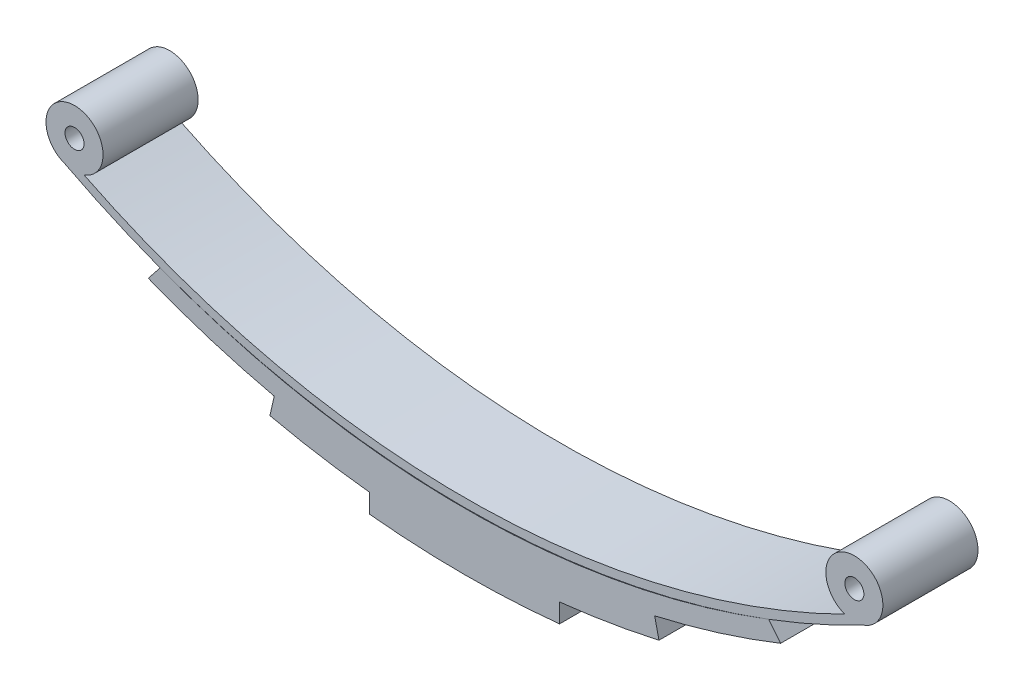
ISO-10303-21;
HEADER;
FILE_DESCRIPTION(('STEP AP214'),'2;1');
FILE_NAME('part.step','',(''),(''),'','','');
FILE_SCHEMA(('AUTOMOTIVE_DESIGN { 1 0 10303 214 1 1 1 1 }'));
ENDSEC;
DATA;
#1=APPLICATION_CONTEXT('core data for automotive mechanical design processes');
#2=APPLICATION_PROTOCOL_DEFINITION('international standard','automotive_design',2000,#1);
#3=PRODUCT_CONTEXT('',#1,'mechanical');
#4=PRODUCT('Part','Part','',(#3));
#5=PRODUCT_RELATED_PRODUCT_CATEGORY('part','',(#4));
#6=PRODUCT_DEFINITION_FORMATION('','',#4);
#7=PRODUCT_DEFINITION_CONTEXT('part definition',#1,'design');
#8=PRODUCT_DEFINITION('design','',#6,#7);
#9=PRODUCT_DEFINITION_SHAPE('','',#8);
#10=(LENGTH_UNIT() NAMED_UNIT(*) SI_UNIT(.MILLI.,.METRE.));
#11=(NAMED_UNIT(*) PLANE_ANGLE_UNIT() SI_UNIT($,.RADIAN.));
#12=(NAMED_UNIT(*) SI_UNIT($,.STERADIAN.) SOLID_ANGLE_UNIT());
#13=UNCERTAINTY_MEASURE_WITH_UNIT(LENGTH_MEASURE(1.E-05),#10,'distance_accuracy_value','');
#14=(GEOMETRIC_REPRESENTATION_CONTEXT(3) GLOBAL_UNCERTAINTY_ASSIGNED_CONTEXT((#13)) GLOBAL_UNIT_ASSIGNED_CONTEXT((#10,
#11,#12)) REPRESENTATION_CONTEXT('',''));
#15=CARTESIAN_POINT('',(0.,0.,0.));
#16=DIRECTION('',(0.,0.,1.));
#17=DIRECTION('',(1.,0.,0.));
#18=AXIS2_PLACEMENT_3D('',#15,#16,#17);
#19=CARTESIAN_POINT('',(0.,78.5770417683242,10.));
#20=DIRECTION('',(0.,0.,-1.));
#21=DIRECTION('',(-1.,0.,0.));
#22=AXIS2_PLACEMENT_3D('',#19,#20,#21);
#23=CYLINDRICAL_SURFACE('',#22,93.);
#24=DIRECTION('',(0.,0.,-1.));
#25=VECTOR('',#24,1.);
#26=CARTESIAN_POINT('',(-10.,-13.8837607373863,10.));
#27=LINE('',#26,#25);
#28=CARTESIAN_POINT('',(-10.,-13.8837607373863,10.));
#29=VERTEX_POINT('',#28);
#30=CARTESIAN_POINT('',(-10.,-13.8837607373863,0.));
#31=VERTEX_POINT('',#30);
#32=EDGE_CURVE('E68',#29,#31,#27,.T.);
#33=ORIENTED_EDGE('',*,*,#32,.F.);
#34=CARTESIAN_POINT('',(0.,78.5770417683242,10.));
#35=DIRECTION('',(0.,0.,1.));
#36=DIRECTION('',(1.,0.,0.));
#37=AXIS2_PLACEMENT_3D('',#34,#35,#36);
#38=CIRCLE('',#37,93.);
#39=CARTESIAN_POINT('',(-20.4558423058385,-12.1453838802367,10.));
#40=VERTEX_POINT('',#39);
#41=EDGE_CURVE('E142',#40,#29,#38,.T.);
#42=ORIENTED_EDGE('',*,*,#41,.F.);
#43=DIRECTION('',(0.,0.,-1.));
#44=VECTOR('',#43,1.);
#45=CARTESIAN_POINT('',(-20.4558423058385,-12.1453838802367,10.));
#46=LINE('',#45,#44);
#47=CARTESIAN_POINT('',(-20.4558423058385,-12.1453838802367,0.));
#48=VERTEX_POINT('',#47);
#49=EDGE_CURVE('E191',#40,#48,#46,.T.);
#50=ORIENTED_EDGE('',*,*,#49,.T.);
#51=CARTESIAN_POINT('',(0.,78.5770417683242,0.));
#52=DIRECTION('',(0.,0.,1.));
#53=DIRECTION('',(1.,0.,0.));
#54=AXIS2_PLACEMENT_3D('',#51,#52,#53);
#55=CIRCLE('',#54,93.);
#56=EDGE_CURVE('E182',#48,#31,#55,.T.);
#57=ORIENTED_EDGE('',*,*,#56,.T.);
#58=EDGE_LOOP('',(#33,#42,#50,#57));
#59=FACE_BOUND('',#58,.T.);
#60=ADVANCED_FACE('F45',(#59),#23,.T.);
#61=DIRECTION('',(0.,0.,-1.));
#62=VECTOR('',#61,1.);
#63=CARTESIAN_POINT('',(10.,-13.8837607373863,10.));
#64=LINE('',#63,#62);
#65=CARTESIAN_POINT('',(10.,-13.8837607373863,10.));
#66=VERTEX_POINT('',#65);
#67=CARTESIAN_POINT('',(10.,-13.8837607373863,0.));
#68=VERTEX_POINT('',#67);
#69=EDGE_CURVE('E160',#66,#68,#64,.T.);
#70=ORIENTED_EDGE('',*,*,#69,.T.);
#71=CARTESIAN_POINT('',(20.4558423058385,-12.1453838802367,0.));
#72=VERTEX_POINT('',#71);
#73=EDGE_CURVE('E181',#68,#72,#55,.T.);
#74=ORIENTED_EDGE('',*,*,#73,.T.);
#75=DIRECTION('',(0.,0.,-1.));
#76=VECTOR('',#75,1.);
#77=CARTESIAN_POINT('',(20.4558423058385,-12.1453838802367,10.));
#78=LINE('',#77,#76);
#79=CARTESIAN_POINT('',(20.4558423058385,-12.1453838802367,10.));
#80=VERTEX_POINT('',#79);
#81=EDGE_CURVE('E188',#80,#72,#78,.T.);
#82=ORIENTED_EDGE('',*,*,#81,.F.);
#83=EDGE_CURVE('E60',#66,#80,#38,.T.);
#84=ORIENTED_EDGE('',*,*,#83,.F.);
#85=EDGE_LOOP('',(#70,#74,#82,#84));
#86=FACE_BOUND('',#85,.T.);
#87=ADVANCED_FACE('F257',(#86),#23,.T.);
#88=CARTESIAN_POINT('',(0.,77.6042599936845,10.));
#89=DIRECTION('',(0.,0.,-1.));
#90=DIRECTION('',(-1.,0.,0.));
#91=AXIS2_PLACEMENT_3D('',#88,#89,#90);
#92=CYLINDRICAL_SURFACE('',#91,90.);
#93=DIRECTION('',(0.,0.,-1.));
#94=VECTOR('',#93,1.);
#95=CARTESIAN_POINT('',(-20.,-10.1453838802367,10.));
#96=LINE('',#95,#94);
#97=CARTESIAN_POINT('',(-20.,-10.1453838802367,10.));
#98=VERTEX_POINT('',#97);
#99=CARTESIAN_POINT('',(-20.,-10.1453838802367,0.));
#100=VERTEX_POINT('',#99);
#101=EDGE_CURVE('E194',#98,#100,#96,.T.);
#102=ORIENTED_EDGE('',*,*,#101,.F.);
#103=CARTESIAN_POINT('',(0.,77.6042599936845,10.));
#104=DIRECTION('',(0.,0.,1.));
#105=DIRECTION('',(1.,0.,0.));
#106=AXIS2_PLACEMENT_3D('',#103,#104,#105);
#107=CIRCLE('',#106,90.);
#108=CARTESIAN_POINT('',(-33.245929305285,-6.03011203497365,10.));
#109=VERTEX_POINT('',#108);
#110=EDGE_CURVE('E204',#109,#98,#107,.T.);
#111=ORIENTED_EDGE('',*,*,#110,.F.);
#112=DIRECTION('',(0.,0.,-1.));
#113=VECTOR('',#112,1.);
#114=CARTESIAN_POINT('',(-33.245929305285,-6.03011203497365,10.));
#115=LINE('',#114,#113);
#116=CARTESIAN_POINT('',(-33.245929305285,-6.03011203497365,0.));
#117=VERTEX_POINT('',#116);
#118=EDGE_CURVE('E53',#109,#117,#115,.T.);
#119=ORIENTED_EDGE('',*,*,#118,.T.);
#120=CARTESIAN_POINT('',(0.,77.6042599936845,0.));
#121=DIRECTION('',(0.,0.,1.));
#122=DIRECTION('',(1.,0.,0.));
#123=AXIS2_PLACEMENT_3D('',#120,#121,#122);
#124=CIRCLE('',#123,90.);
#125=EDGE_CURVE('E215',#117,#100,#124,.T.);
#126=ORIENTED_EDGE('',*,*,#125,.T.);
#127=EDGE_LOOP('',(#102,#111,#119,#126));
#128=FACE_BOUND('',#127,.T.);
#129=ADVANCED_FACE('F227',(#128),#92,.T.);
#130=DIRECTION('',(0.,0.,-1.));
#131=VECTOR('',#130,1.);
#132=CARTESIAN_POINT('',(20.,-10.1453838802367,10.));
#133=LINE('',#132,#131);
#134=CARTESIAN_POINT('',(20.,-10.1453838802367,10.));
#135=VERTEX_POINT('',#134);
#136=CARTESIAN_POINT('',(20.,-10.1453838802367,0.));
#137=VERTEX_POINT('',#136);
#138=EDGE_CURVE('E179',#135,#137,#133,.T.);
#139=ORIENTED_EDGE('',*,*,#138,.T.);
#140=CARTESIAN_POINT('',(33.245929305285,-6.03011203497364,0.));
#141=VERTEX_POINT('',#140);
#142=EDGE_CURVE('E214',#137,#141,#124,.T.);
#143=ORIENTED_EDGE('',*,*,#142,.T.);
#144=DIRECTION('',(0.,0.,-1.));
#145=VECTOR('',#144,1.);
#146=CARTESIAN_POINT('',(33.245929305285,-6.03011203497364,10.));
#147=LINE('',#146,#145);
#148=CARTESIAN_POINT('',(33.245929305285,-6.03011203497364,10.));
#149=VERTEX_POINT('',#148);
#150=EDGE_CURVE('E220',#149,#141,#147,.T.);
#151=ORIENTED_EDGE('',*,*,#150,.F.);
#152=EDGE_CURVE('E203',#135,#149,#107,.T.);
#153=ORIENTED_EDGE('',*,*,#152,.F.);
#154=EDGE_LOOP('',(#139,#143,#151,#153));
#155=FACE_BOUND('',#154,.T.);
#156=ADVANCED_FACE('F250',(#155),#92,.T.);
#157=CARTESIAN_POINT('',(0.,79.6533513175073,10.));
#158=DIRECTION('',(0.,0.,-1.));
#159=DIRECTION('',(-1.,0.,0.));
#160=AXIS2_PLACEMENT_3D('',#157,#158,#159);
#161=CYLINDRICAL_SURFACE('',#160,90.);
#162=CARTESIAN_POINT('',(0.,79.6533513175073,0.));
#163=DIRECTION('',(0.,0.,-1.));
#164=DIRECTION('',(1.,0.,0.));
#165=AXIS2_PLACEMENT_3D('',#162,#163,#164);
#166=CIRCLE('',#165,90.);
#167=CARTESIAN_POINT('',(32.,-4.46561206174508,0.));
#168=VERTEX_POINT('',#167);
#169=CARTESIAN_POINT('',(-32.,-4.46561206174509,0.));
#170=VERTEX_POINT('',#169);
#171=EDGE_CURVE('E197',#168,#170,#166,.T.);
#172=ORIENTED_EDGE('',*,*,#171,.T.);
#173=DIRECTION('',(0.,0.,-1.));
#174=VECTOR('',#173,1.);
#175=CARTESIAN_POINT('',(-32.,-4.46561206174509,10.));
#176=LINE('',#175,#174);
#177=CARTESIAN_POINT('',(-32.,-4.46561206174509,10.));
#178=VERTEX_POINT('',#177);
#179=EDGE_CURVE('E12',#178,#170,#176,.T.);
#180=ORIENTED_EDGE('',*,*,#179,.F.);
#181=CARTESIAN_POINT('',(0.,79.6533513175073,10.));
#182=DIRECTION('',(0.,0.,-1.));
#183=DIRECTION('',(1.,0.,0.));
#184=AXIS2_PLACEMENT_3D('',#181,#182,#183);
#185=CIRCLE('',#184,90.);
#186=CARTESIAN_POINT('',(32.,-4.46561206174508,10.));
#187=VERTEX_POINT('',#186);
#188=EDGE_CURVE('E198',#187,#178,#185,.T.);
#189=ORIENTED_EDGE('',*,*,#188,.F.);
#190=DIRECTION('',(0.,0.,-1.));
#191=VECTOR('',#190,1.);
#192=CARTESIAN_POINT('',(32.,-4.46561206174508,10.));
#193=LINE('',#192,#191);
#194=EDGE_CURVE('E209',#187,#168,#193,.T.);
#195=ORIENTED_EDGE('',*,*,#194,.T.);
#196=EDGE_LOOP('',(#172,#180,#189,#195));
#197=FACE_BOUND('',#196,.T.);
#198=ADVANCED_FACE('F47',(#197),#161,.F.);
#199=CARTESIAN_POINT('',(-33.245929305285,-6.03011203497365,10.));
#200=DIRECTION('',(0.782249986614277,-0.622964652642478,0.));
#201=DIRECTION('',(0.622964652642478,0.782249986614277,0.));
#202=AXIS2_PLACEMENT_3D('',#199,#200,#201);
#203=PLANE('',#202);
#204=DIRECTION('',(-0.622964652642478,-0.782249986614277,0.));
#205=VECTOR('',#204,1.);
#206=CARTESIAN_POINT('',(-33.245929305285,-6.03011203497365,0.));
#207=LINE('',#206,#205);
#208=EDGE_CURVE('E212',#170,#117,#207,.T.);
#209=ORIENTED_EDGE('',*,*,#208,.T.);
#210=ORIENTED_EDGE('',*,*,#118,.F.);
#211=DIRECTION('',(-0.622964652642478,-0.782249986614277,0.));
#212=VECTOR('',#211,1.);
#213=CARTESIAN_POINT('',(-33.245929305285,-6.03011203497365,10.));
#214=LINE('',#213,#212);
#215=EDGE_CURVE('E200',#178,#109,#214,.T.);
#216=ORIENTED_EDGE('',*,*,#215,.F.);
#217=ORIENTED_EDGE('',*,*,#179,.T.);
#218=EDGE_LOOP('',(#209,#210,#216,#217));
#219=FACE_BOUND('',#218,.T.);
#220=ADVANCED_FACE('F240',(#219),#203,.F.);
#221=CARTESIAN_POINT('',(32.,-4.46561206174508,10.));
#222=DIRECTION('',(-0.782249986614283,-0.622964652642471,0.));
#223=DIRECTION('',(0.622964652642471,-0.782249986614283,0.));
#224=AXIS2_PLACEMENT_3D('',#221,#222,#223);
#225=PLANE('',#224);
#226=DIRECTION('',(-0.622964652642471,0.782249986614283,0.));
#227=VECTOR('',#226,1.);
#228=CARTESIAN_POINT('',(32.,-4.46561206174508,0.));
#229=LINE('',#228,#227);
#230=EDGE_CURVE('E201',#141,#168,#229,.T.);
#231=ORIENTED_EDGE('',*,*,#230,.T.);
#232=ORIENTED_EDGE('',*,*,#194,.F.);
#233=DIRECTION('',(-0.622964652642471,0.782249986614283,0.));
#234=VECTOR('',#233,1.);
#235=CARTESIAN_POINT('',(32.,-4.46561206174508,10.));
#236=LINE('',#235,#234);
#237=EDGE_CURVE('E207',#149,#187,#236,.T.);
#238=ORIENTED_EDGE('',*,*,#237,.F.);
#239=ORIENTED_EDGE('',*,*,#150,.T.);
#240=EDGE_LOOP('',(#231,#232,#238,#239));
#241=FACE_BOUND('',#240,.T.);
#242=ADVANCED_FACE('F246',(#241),#225,.F.);
#243=CARTESIAN_POINT('',(0.,79.6533513175073,10.));
#244=DIRECTION('',(0.,0.,1.));
#245=DIRECTION('',(1.,0.,0.));
#246=AXIS2_PLACEMENT_3D('',#243,#244,#245);
#247=PLANE('',#246);
#248=ORIENTED_EDGE('',*,*,#188,.T.);
#249=ORIENTED_EDGE('',*,*,#215,.T.);
#250=ORIENTED_EDGE('',*,*,#110,.T.);
#251=DIRECTION('',(-0.222222222222214,-0.974996043043571,0.));
#252=VECTOR('',#251,1.);
#253=CARTESIAN_POINT('',(-20.,-10.1453838802367,10.));
#254=LINE('',#253,#252);
#255=EDGE_CURVE('E172',#98,#40,#254,.T.);
#256=ORIENTED_EDGE('',*,*,#255,.T.);
#257=ORIENTED_EDGE('',*,*,#41,.T.);
#258=DIRECTION('',(0.,-1.,0.));
#259=VECTOR('',#258,1.);
#260=CARTESIAN_POINT('',(-10.,-13.8837607373863,10.));
#261=LINE('',#260,#259);
#262=CARTESIAN_POINT('',(-10.,-15.8837607373863,10.));
#263=VERTEX_POINT('',#262);
#264=EDGE_CURVE('E135',#29,#263,#261,.T.);
#265=ORIENTED_EDGE('',*,*,#264,.T.);
#266=CARTESIAN_POINT('',(0.,81.6047001182452,10.));
#267=DIRECTION('',(0.,0.,1.));
#268=DIRECTION('',(1.,0.,0.));
#269=AXIS2_PLACEMENT_3D('',#266,#267,#268);
#270=CIRCLE('',#269,98.);
#271=CARTESIAN_POINT('',(9.99999999999994,-15.8837607373863,10.));
#272=VERTEX_POINT('',#271);
#273=EDGE_CURVE('E140',#263,#272,#270,.T.);
#274=ORIENTED_EDGE('',*,*,#273,.T.);
#275=DIRECTION('',(0.,1.,0.));
#276=VECTOR('',#275,1.);
#277=CARTESIAN_POINT('',(10.,-13.8837607373863,10.));
#278=LINE('',#277,#276);
#279=EDGE_CURVE('E158',#272,#66,#278,.T.);
#280=ORIENTED_EDGE('',*,*,#279,.T.);
#281=ORIENTED_EDGE('',*,*,#83,.T.);
#282=DIRECTION('',(-0.222222222222214,0.974996043043571,0.));
#283=VECTOR('',#282,1.);
#284=CARTESIAN_POINT('',(20.,-10.1453838802367,10.));
#285=LINE('',#284,#283);
#286=EDGE_CURVE('E176',#80,#135,#285,.T.);
#287=ORIENTED_EDGE('',*,*,#286,.T.);
#288=ORIENTED_EDGE('',*,*,#152,.T.);
#289=ORIENTED_EDGE('',*,*,#237,.T.);
#290=EDGE_LOOP('',(#248,#249,#250,#256,#257,#265,#274,#280,#281,#287,#288,#289));
#291=FACE_BOUND('',#290,.T.);
#292=ADVANCED_FACE('F138',(#291),#247,.T.);
#293=CARTESIAN_POINT('',(0.,79.6533513175073,0.));
#294=DIRECTION('',(0.,0.,1.));
#295=DIRECTION('',(1.,0.,0.));
#296=AXIS2_PLACEMENT_3D('',#293,#294,#295);
#297=PLANE('',#296);
#298=ORIENTED_EDGE('',*,*,#171,.F.);
#299=ORIENTED_EDGE('',*,*,#230,.F.);
#300=ORIENTED_EDGE('',*,*,#142,.F.);
#301=DIRECTION('',(-0.222222222222214,0.974996043043571,0.));
#302=VECTOR('',#301,1.);
#303=CARTESIAN_POINT('',(20.,-10.1453838802367,0.));
#304=LINE('',#303,#302);
#305=EDGE_CURVE('E174',#72,#137,#304,.T.);
#306=ORIENTED_EDGE('',*,*,#305,.F.);
#307=ORIENTED_EDGE('',*,*,#73,.F.);
#308=DIRECTION('',(0.,1.,0.));
#309=VECTOR('',#308,1.);
#310=CARTESIAN_POINT('',(10.,-13.8837607373863,0.));
#311=LINE('',#310,#309);
#312=CARTESIAN_POINT('',(9.99999999999994,-15.8837607373863,0.));
#313=VERTEX_POINT('',#312);
#314=EDGE_CURVE('E144',#313,#68,#311,.T.);
#315=ORIENTED_EDGE('',*,*,#314,.F.);
#316=CARTESIAN_POINT('',(0.,81.6047001182452,0.));
#317=DIRECTION('',(0.,0.,1.));
#318=DIRECTION('',(1.,0.,0.));
#319=AXIS2_PLACEMENT_3D('',#316,#317,#318);
#320=CIRCLE('',#319,98.);
#321=CARTESIAN_POINT('',(-10.,-15.8837607373863,0.));
#322=VERTEX_POINT('',#321);
#323=EDGE_CURVE('E164',#322,#313,#320,.T.);
#324=ORIENTED_EDGE('',*,*,#323,.F.);
#325=DIRECTION('',(0.,-1.,0.));
#326=VECTOR('',#325,1.);
#327=CARTESIAN_POINT('',(-10.,-13.8837607373863,0.));
#328=LINE('',#327,#326);
#329=EDGE_CURVE('E150',#31,#322,#328,.T.);
#330=ORIENTED_EDGE('',*,*,#329,.F.);
#331=ORIENTED_EDGE('',*,*,#56,.F.);
#332=DIRECTION('',(-0.222222222222214,-0.974996043043571,0.));
#333=VECTOR('',#332,1.);
#334=CARTESIAN_POINT('',(-20.,-10.1453838802367,0.));
#335=LINE('',#334,#333);
#336=EDGE_CURVE('E171',#100,#48,#335,.T.);
#337=ORIENTED_EDGE('',*,*,#336,.F.);
#338=ORIENTED_EDGE('',*,*,#125,.F.);
#339=ORIENTED_EDGE('',*,*,#208,.F.);
#340=EDGE_LOOP('',(#298,#299,#300,#306,#307,#315,#324,#330,#331,#337,#338,#339));
#341=FACE_BOUND('',#340,.T.);
#342=ADVANCED_FACE('F232',(#341),#297,.F.);
#343=CARTESIAN_POINT('',(-20.,-10.1453838802367,10.));
#344=DIRECTION('',(0.974996043043571,-0.222222222222214,0.));
#345=DIRECTION('',(0.222222222222214,0.974996043043571,0.));
#346=AXIS2_PLACEMENT_3D('',#343,#344,#345);
#347=PLANE('',#346);
#348=ORIENTED_EDGE('',*,*,#336,.T.);
#349=ORIENTED_EDGE('',*,*,#49,.F.);
#350=ORIENTED_EDGE('',*,*,#255,.F.);
#351=ORIENTED_EDGE('',*,*,#101,.T.);
#352=EDGE_LOOP('',(#348,#349,#350,#351));
#353=FACE_BOUND('',#352,.T.);
#354=ADVANCED_FACE('F237',(#353),#347,.F.);
#355=CARTESIAN_POINT('',(20.,-10.1453838802367,10.));
#356=DIRECTION('',(-0.974996043043571,-0.222222222222214,0.));
#357=DIRECTION('',(0.222222222222214,-0.974996043043571,0.));
#358=AXIS2_PLACEMENT_3D('',#355,#356,#357);
#359=PLANE('',#358);
#360=ORIENTED_EDGE('',*,*,#305,.T.);
#361=ORIENTED_EDGE('',*,*,#138,.F.);
#362=ORIENTED_EDGE('',*,*,#286,.F.);
#363=ORIENTED_EDGE('',*,*,#81,.T.);
#364=EDGE_LOOP('',(#360,#361,#362,#363));
#365=FACE_BOUND('',#364,.T.);
#366=ADVANCED_FACE('F254',(#365),#359,.F.);
#367=CARTESIAN_POINT('',(-10.,-13.8837607373863,10.));
#368=DIRECTION('',(1.,0.,0.));
#369=DIRECTION('',(0.,0.,-1.));
#370=AXIS2_PLACEMENT_3D('',#367,#368,#369);
#371=PLANE('',#370);
#372=ORIENTED_EDGE('',*,*,#329,.T.);
#373=DIRECTION('',(0.,0.,-1.));
#374=VECTOR('',#373,1.);
#375=CARTESIAN_POINT('',(-10.,-15.8837607373863,10.));
#376=LINE('',#375,#374);
#377=EDGE_CURVE('E147',#263,#322,#376,.T.);
#378=ORIENTED_EDGE('',*,*,#377,.F.);
#379=ORIENTED_EDGE('',*,*,#264,.F.);
#380=ORIENTED_EDGE('',*,*,#32,.T.);
#381=EDGE_LOOP('',(#372,#378,#379,#380));
#382=FACE_BOUND('',#381,.T.);
#383=ADVANCED_FACE('F148',(#382),#371,.F.);
#384=CARTESIAN_POINT('',(0.,81.6047001182452,10.));
#385=DIRECTION('',(0.,0.,-1.));
#386=DIRECTION('',(-1.,0.,0.));
#387=AXIS2_PLACEMENT_3D('',#384,#385,#386);
#388=CYLINDRICAL_SURFACE('',#387,98.);
#389=ORIENTED_EDGE('',*,*,#323,.T.);
#390=DIRECTION('',(0.,0.,-1.));
#391=VECTOR('',#390,1.);
#392=CARTESIAN_POINT('',(9.99999999999994,-15.8837607373863,10.));
#393=LINE('',#392,#391);
#394=EDGE_CURVE('E153',#272,#313,#393,.T.);
#395=ORIENTED_EDGE('',*,*,#394,.F.);
#396=ORIENTED_EDGE('',*,*,#273,.F.);
#397=ORIENTED_EDGE('',*,*,#377,.T.);
#398=EDGE_LOOP('',(#389,#395,#396,#397));
#399=FACE_BOUND('',#398,.T.);
#400=ADVANCED_FACE('F155',(#399),#388,.T.);
#401=CARTESIAN_POINT('',(10.,-13.8837607373863,10.));
#402=DIRECTION('',(-1.,0.,0.));
#403=DIRECTION('',(0.,0.,1.));
#404=AXIS2_PLACEMENT_3D('',#401,#402,#403);
#405=PLANE('',#404);
#406=ORIENTED_EDGE('',*,*,#314,.T.);
#407=ORIENTED_EDGE('',*,*,#69,.F.);
#408=ORIENTED_EDGE('',*,*,#279,.F.);
#409=ORIENTED_EDGE('',*,*,#394,.T.);
#410=EDGE_LOOP('',(#406,#407,#408,#409));
#411=FACE_BOUND('',#410,.T.);
#412=ADVANCED_FACE('F259',(#411),#405,.F.);
#413=CLOSED_SHELL('',(#60,#87,#129,#156,#198,#220,#242,#292,#342,#354,#366,#383,#400,#412));
#414=MANIFOLD_SOLID_BREP('B2',#413);
#415=CARTESIAN_POINT('',(-20.5,41.7255023038658,10.));
#416=DIRECTION('',(0.,0.,-1.));
#417=DIRECTION('',(-1.,0.,0.));
#418=AXIS2_PLACEMENT_3D('',#415,#416,#417);
#419=PLANE('',#418);
#420=CARTESIAN_POINT('',(-41.,2.82842712474619,10.));
#421=DIRECTION('',(0.,0.,1.));
#422=DIRECTION('',(-1.,0.,0.));
#423=AXIS2_PLACEMENT_3D('',#420,#421,#422);
#424=CIRCLE('',#423,3.);
#425=CARTESIAN_POINT('',(-40.,0.,10.));
#426=VERTEX_POINT('',#425);
#427=CARTESIAN_POINT('',(-42.,0.,10.));
#428=VERTEX_POINT('',#427);
#429=EDGE_CURVE('E435',#426,#428,#424,.T.);
#430=ORIENTED_EDGE('',*,*,#429,.T.);
#431=CARTESIAN_POINT('',(0.,80.6225774829855,10.));
#432=DIRECTION('',(0.,0.,1.));
#433=DIRECTION('',(1.,0.,0.));
#434=AXIS2_PLACEMENT_3D('',#431,#432,#433);
#435=CIRCLE('',#434,90.9065454189081);
#436=CARTESIAN_POINT('',(42.,0.,10.));
#437=VERTEX_POINT('',#436);
#438=EDGE_CURVE('E430',#428,#437,#435,.T.);
#439=ORIENTED_EDGE('',*,*,#438,.T.);
#440=CARTESIAN_POINT('',(41.,2.82842712474619,10.));
#441=DIRECTION('',(0.,0.,1.));
#442=DIRECTION('',(-1.,0.,0.));
#443=AXIS2_PLACEMENT_3D('',#440,#441,#442);
#444=CIRCLE('',#443,3.);
#445=CARTESIAN_POINT('',(39.9999999999999,0.,10.));
#446=VERTEX_POINT('',#445);
#447=EDGE_CURVE('E433',#437,#446,#444,.T.);
#448=ORIENTED_EDGE('',*,*,#447,.T.);
#449=CARTESIAN_POINT('',(0.,80.6225774829855,10.));
#450=DIRECTION('',(0.,0.,-1.));
#451=DIRECTION('',(1.,0.,0.));
#452=AXIS2_PLACEMENT_3D('',#449,#450,#451);
#453=CIRCLE('',#452,90.);
#454=EDGE_CURVE('E400',#446,#426,#453,.T.);
#455=ORIENTED_EDGE('',*,*,#454,.T.);
#456=EDGE_LOOP('',(#430,#439,#448,#455));
#457=FACE_BOUND('',#456,.T.);
#458=CARTESIAN_POINT('',(-41.,2.82842712474619,10.));
#459=DIRECTION('',(0.,0.,1.));
#460=DIRECTION('',(1.,0.,0.));
#461=AXIS2_PLACEMENT_3D('',#458,#459,#460);
#462=CIRCLE('',#461,0.999999999999998);
#463=CARTESIAN_POINT('',(-40.,2.82842712474619,10.));
#464=VERTEX_POINT('',#463);
#465=EDGE_CURVE('E450',#464,#464,#462,.T.);
#466=ORIENTED_EDGE('',*,*,#465,.F.);
#467=EDGE_LOOP('',(#466));
#468=FACE_BOUND('',#467,.T.);
#469=CARTESIAN_POINT('',(41.,2.82842712474619,10.));
#470=DIRECTION('',(0.,0.,1.));
#471=DIRECTION('',(1.,0.,0.));
#472=AXIS2_PLACEMENT_3D('',#469,#470,#471);
#473=CIRCLE('',#472,0.999999999999998);
#474=CARTESIAN_POINT('',(42.,2.82842712474619,10.));
#475=VERTEX_POINT('',#474);
#476=EDGE_CURVE('E465',#475,#475,#473,.T.);
#477=ORIENTED_EDGE('',*,*,#476,.F.);
#478=EDGE_LOOP('',(#477));
#479=FACE_BOUND('',#478,.T.);
#480=ADVANCED_FACE('F383',(#457,#468,#479),#419,.F.);
#481=CARTESIAN_POINT('',(-20.5,41.7255023038658,0.));
#482=DIRECTION('',(0.,0.,-1.));
#483=DIRECTION('',(-1.,0.,0.));
#484=AXIS2_PLACEMENT_3D('',#481,#482,#483);
#485=PLANE('',#484);
#486=CARTESIAN_POINT('',(-41.,2.82842712474619,0.));
#487=DIRECTION('',(0.,0.,1.));
#488=DIRECTION('',(1.,0.,0.));
#489=AXIS2_PLACEMENT_3D('',#486,#487,#488);
#490=CIRCLE('',#489,0.999999999999998);
#491=CARTESIAN_POINT('',(-40.,2.82842712474619,0.));
#492=VERTEX_POINT('',#491);
#493=EDGE_CURVE('E462',#492,#492,#490,.T.);
#494=ORIENTED_EDGE('',*,*,#493,.T.);
#495=EDGE_LOOP('',(#494));
#496=FACE_BOUND('',#495,.T.);
#497=CARTESIAN_POINT('',(-41.,2.82842712474619,0.));
#498=DIRECTION('',(0.,0.,1.));
#499=DIRECTION('',(-1.,0.,0.));
#500=AXIS2_PLACEMENT_3D('',#497,#498,#499);
#501=CIRCLE('',#500,3.);
#502=CARTESIAN_POINT('',(-40.,0.,0.));
#503=VERTEX_POINT('',#502);
#504=CARTESIAN_POINT('',(-42.,0.,0.));
#505=VERTEX_POINT('',#504);
#506=EDGE_CURVE('E447',#503,#505,#501,.T.);
#507=ORIENTED_EDGE('',*,*,#506,.F.);
#508=CARTESIAN_POINT('',(0.,80.6225774829855,0.));
#509=DIRECTION('',(0.,0.,-1.));
#510=DIRECTION('',(1.,0.,0.));
#511=AXIS2_PLACEMENT_3D('',#508,#509,#510);
#512=CIRCLE('',#511,90.);
#513=CARTESIAN_POINT('',(39.9999999999999,0.,0.));
#514=VERTEX_POINT('',#513);
#515=EDGE_CURVE('E423',#514,#503,#512,.T.);
#516=ORIENTED_EDGE('',*,*,#515,.F.);
#517=CARTESIAN_POINT('',(41.,2.82842712474619,0.));
#518=DIRECTION('',(0.,0.,1.));
#519=DIRECTION('',(-1.,0.,0.));
#520=AXIS2_PLACEMENT_3D('',#517,#518,#519);
#521=CIRCLE('',#520,3.);
#522=CARTESIAN_POINT('',(42.,0.,0.));
#523=VERTEX_POINT('',#522);
#524=EDGE_CURVE('E417',#523,#514,#521,.T.);
#525=ORIENTED_EDGE('',*,*,#524,.F.);
#526=CARTESIAN_POINT('',(0.,80.6225774829855,0.));
#527=DIRECTION('',(0.,0.,1.));
#528=DIRECTION('',(1.,0.,0.));
#529=AXIS2_PLACEMENT_3D('',#526,#527,#528);
#530=CIRCLE('',#529,90.9065454189081);
#531=EDGE_CURVE('E439',#505,#523,#530,.T.);
#532=ORIENTED_EDGE('',*,*,#531,.F.);
#533=EDGE_LOOP('',(#507,#516,#525,#532));
#534=FACE_BOUND('',#533,.T.);
#535=CARTESIAN_POINT('',(41.,2.82842712474619,0.));
#536=DIRECTION('',(0.,0.,1.));
#537=DIRECTION('',(1.,0.,0.));
#538=AXIS2_PLACEMENT_3D('',#535,#536,#537);
#539=CIRCLE('',#538,0.999999999999998);
#540=CARTESIAN_POINT('',(42.,2.82842712474619,0.));
#541=VERTEX_POINT('',#540);
#542=EDGE_CURVE('E468',#541,#541,#539,.T.);
#543=ORIENTED_EDGE('',*,*,#542,.T.);
#544=EDGE_LOOP('',(#543));
#545=FACE_BOUND('',#544,.T.);
#546=ADVANCED_FACE('F458',(#496,#534,#545),#485,.T.);
#547=CARTESIAN_POINT('',(-41.,2.82842712474619,10.));
#548=DIRECTION('',(0.,0.,-1.));
#549=DIRECTION('',(-1.,0.,0.));
#550=AXIS2_PLACEMENT_3D('',#547,#548,#549);
#551=CYLINDRICAL_SURFACE('',#550,3.);
#552=ORIENTED_EDGE('',*,*,#506,.T.);
#553=DIRECTION('',(0.,0.,-1.));
#554=VECTOR('',#553,1.);
#555=CARTESIAN_POINT('',(-42.,0.,10.));
#556=LINE('',#555,#554);
#557=EDGE_CURVE('E43',#428,#505,#556,.T.);
#558=ORIENTED_EDGE('',*,*,#557,.F.);
#559=ORIENTED_EDGE('',*,*,#429,.F.);
#560=DIRECTION('',(0.,0.,-1.));
#561=VECTOR('',#560,1.);
#562=CARTESIAN_POINT('',(-40.,0.,10.));
#563=LINE('',#562,#561);
#564=EDGE_CURVE('E443',#426,#503,#563,.T.);
#565=ORIENTED_EDGE('',*,*,#564,.T.);
#566=EDGE_LOOP('',(#552,#558,#559,#565));
#567=FACE_BOUND('',#566,.T.);
#568=ADVANCED_FACE('F385',(#567),#551,.T.);
#569=CARTESIAN_POINT('',(0.,80.6225774829855,10.));
#570=DIRECTION('',(0.,0.,-1.));
#571=DIRECTION('',(-1.,0.,0.));
#572=AXIS2_PLACEMENT_3D('',#569,#570,#571);
#573=CYLINDRICAL_SURFACE('',#572,90.9065454189081);
#574=ORIENTED_EDGE('',*,*,#531,.T.);
#575=DIRECTION('',(0.,0.,-1.));
#576=VECTOR('',#575,1.);
#577=CARTESIAN_POINT('',(42.,0.,10.));
#578=LINE('',#577,#576);
#579=EDGE_CURVE('E392',#437,#523,#578,.T.);
#580=ORIENTED_EDGE('',*,*,#579,.F.);
#581=ORIENTED_EDGE('',*,*,#438,.F.);
#582=ORIENTED_EDGE('',*,*,#557,.T.);
#583=EDGE_LOOP('',(#574,#580,#581,#582));
#584=FACE_BOUND('',#583,.T.);
#585=ADVANCED_FACE('F438',(#584),#573,.T.);
#586=CARTESIAN_POINT('',(41.,2.82842712474619,10.));
#587=DIRECTION('',(0.,0.,-1.));
#588=DIRECTION('',(-1.,0.,0.));
#589=AXIS2_PLACEMENT_3D('',#586,#587,#588);
#590=CYLINDRICAL_SURFACE('',#589,3.);
#591=ORIENTED_EDGE('',*,*,#524,.T.);
#592=DIRECTION('',(0.,0.,-1.));
#593=VECTOR('',#592,1.);
#594=CARTESIAN_POINT('',(39.9999999999999,0.,10.));
#595=LINE('',#594,#593);
#596=EDGE_CURVE('E440',#446,#514,#595,.T.);
#597=ORIENTED_EDGE('',*,*,#596,.F.);
#598=ORIENTED_EDGE('',*,*,#447,.F.);
#599=ORIENTED_EDGE('',*,*,#579,.T.);
#600=EDGE_LOOP('',(#591,#597,#598,#599));
#601=FACE_BOUND('',#600,.T.);
#602=ADVANCED_FACE('F441',(#601),#590,.T.);
#603=CARTESIAN_POINT('',(0.,80.6225774829855,10.));
#604=DIRECTION('',(0.,0.,-1.));
#605=DIRECTION('',(-1.,0.,0.));
#606=AXIS2_PLACEMENT_3D('',#603,#604,#605);
#607=CYLINDRICAL_SURFACE('',#606,90.);
#608=ORIENTED_EDGE('',*,*,#515,.T.);
#609=ORIENTED_EDGE('',*,*,#564,.F.);
#610=ORIENTED_EDGE('',*,*,#454,.F.);
#611=ORIENTED_EDGE('',*,*,#596,.T.);
#612=EDGE_LOOP('',(#608,#609,#610,#611));
#613=FACE_BOUND('',#612,.T.);
#614=ADVANCED_FACE('F455',(#613),#607,.F.);
#615=CARTESIAN_POINT('',(-41.,2.82842712474619,10.));
#616=DIRECTION('',(0.,0.,-1.));
#617=DIRECTION('',(-1.,0.,0.));
#618=AXIS2_PLACEMENT_3D('',#615,#616,#617);
#619=CYLINDRICAL_SURFACE('',#618,0.999999999999998);
#620=ORIENTED_EDGE('',*,*,#465,.T.);
#621=EDGE_LOOP('',(#620));
#622=FACE_BOUND('',#621,.T.);
#623=ORIENTED_EDGE('',*,*,#493,.F.);
#624=EDGE_LOOP('',(#623));
#625=FACE_BOUND('',#624,.T.);
#626=ADVANCED_FACE('F485',(#622,#625),#619,.F.);
#627=CARTESIAN_POINT('',(41.,2.82842712474619,10.));
#628=DIRECTION('',(0.,0.,-1.));
#629=DIRECTION('',(-1.,0.,0.));
#630=AXIS2_PLACEMENT_3D('',#627,#628,#629);
#631=CYLINDRICAL_SURFACE('',#630,0.999999999999998);
#632=ORIENTED_EDGE('',*,*,#476,.T.);
#633=EDGE_LOOP('',(#632));
#634=FACE_BOUND('',#633,.T.);
#635=ORIENTED_EDGE('',*,*,#542,.F.);
#636=EDGE_LOOP('',(#635));
#637=FACE_BOUND('',#636,.T.);
#638=ADVANCED_FACE('F474',(#634,#637),#631,.F.);
#639=CLOSED_SHELL('',(#480,#546,#568,#585,#602,#614,#626,#638));
#640=MANIFOLD_SOLID_BREP('B6',#639);
#641=ADVANCED_BREP_SHAPE_REPRESENTATION('',(#18,#414,#640),#14);
#642=SHAPE_DEFINITION_REPRESENTATION(#9,#641);
ENDSEC;
END-ISO-10303-21;
